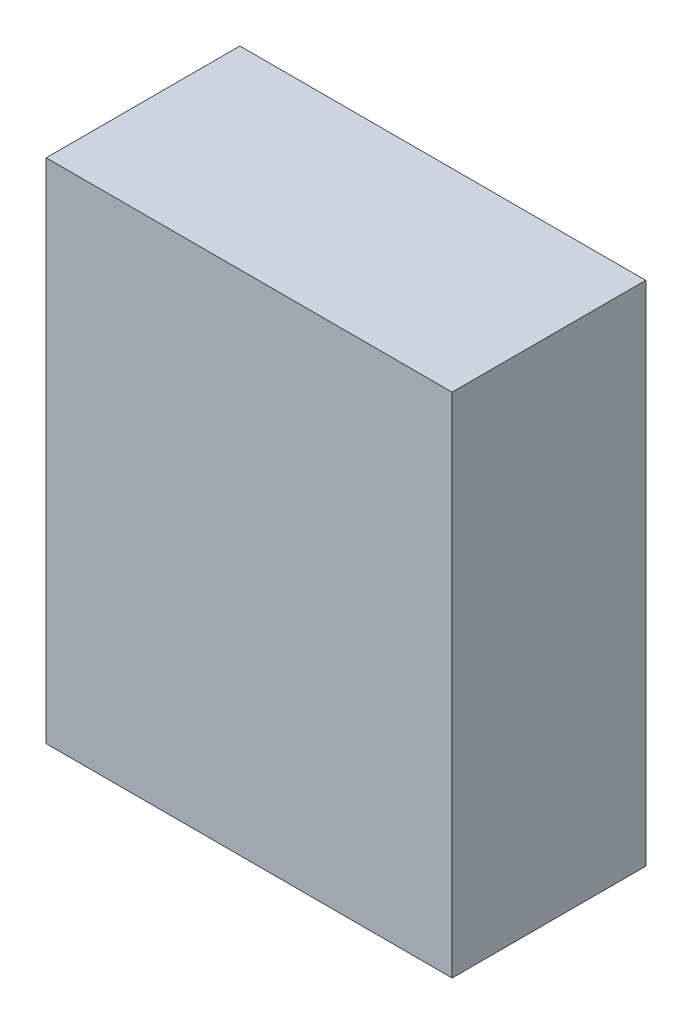
ISO-10303-21;
HEADER;
FILE_DESCRIPTION(('STEP AP214'),'2;1');
FILE_NAME('part.step','',(''),(''),'','','');
FILE_SCHEMA(('AUTOMOTIVE_DESIGN { 1 0 10303 214 1 1 1 1 }'));
ENDSEC;
DATA;
#1=APPLICATION_CONTEXT('core data for automotive mechanical design processes');
#2=APPLICATION_PROTOCOL_DEFINITION('international standard','automotive_design',2000,#1);
#3=PRODUCT_CONTEXT('',#1,'mechanical');
#4=PRODUCT('Part','Part','',(#3));
#5=PRODUCT_RELATED_PRODUCT_CATEGORY('part','',(#4));
#6=PRODUCT_DEFINITION_FORMATION('','',#4);
#7=PRODUCT_DEFINITION_CONTEXT('part definition',#1,'design');
#8=PRODUCT_DEFINITION('design','',#6,#7);
#9=PRODUCT_DEFINITION_SHAPE('','',#8);
#10=(LENGTH_UNIT() NAMED_UNIT(*) SI_UNIT(.MILLI.,.METRE.));
#11=(NAMED_UNIT(*) PLANE_ANGLE_UNIT() SI_UNIT($,.RADIAN.));
#12=(NAMED_UNIT(*) SI_UNIT($,.STERADIAN.) SOLID_ANGLE_UNIT());
#13=UNCERTAINTY_MEASURE_WITH_UNIT(LENGTH_MEASURE(1.E-05),#10,'distance_accuracy_value','');
#14=(GEOMETRIC_REPRESENTATION_CONTEXT(3) GLOBAL_UNCERTAINTY_ASSIGNED_CONTEXT((#13)) GLOBAL_UNIT_ASSIGNED_CONTEXT((#10,
#11,#12)) REPRESENTATION_CONTEXT('',''));
#15=CARTESIAN_POINT('',(0.,0.,0.));
#16=DIRECTION('',(0.,0.,1.));
#17=DIRECTION('',(1.,0.,0.));
#18=AXIS2_PLACEMENT_3D('',#15,#16,#17);
#19=CARTESIAN_POINT('',(2.40000028,-2.99999908,2.2900005));
#20=DIRECTION('',(0.,0.,-1.));
#21=DIRECTION('',(-1.,0.,0.));
#22=AXIS2_PLACEMENT_3D('',#19,#20,#21);
#23=PLANE('',#22);
#24=DIRECTION('',(1.,0.,0.));
#25=VECTOR('',#24,1.);
#26=CARTESIAN_POINT('',(2.40000028,2.99999908,2.2900005));
#27=LINE('',#26,#25);
#28=CARTESIAN_POINT('',(2.40000028,2.99999908,2.2900005));
#29=VERTEX_POINT('',#28);
#30=CARTESIAN_POINT('',(-2.40000028,2.99999908,2.2900005));
#31=VERTEX_POINT('',#30);
#32=EDGE_CURVE('E55',#29,#31,#27,.F.);
#33=ORIENTED_EDGE('',*,*,#32,.T.);
#34=DIRECTION('',(0.,1.,0.));
#35=VECTOR('',#34,1.);
#36=CARTESIAN_POINT('',(-2.40000028,2.99999908,2.2900005));
#37=LINE('',#36,#35);
#38=CARTESIAN_POINT('',(-2.40000028,-2.99999908,2.2900005));
#39=VERTEX_POINT('',#38);
#40=EDGE_CURVE('E57',#31,#39,#37,.F.);
#41=ORIENTED_EDGE('',*,*,#40,.T.);
#42=DIRECTION('',(1.,0.,0.));
#43=VECTOR('',#42,1.);
#44=CARTESIAN_POINT('',(-2.40000028,-2.99999908,2.2900005));
#45=LINE('',#44,#43);
#46=CARTESIAN_POINT('',(2.40000028,-2.99999908,2.2900005));
#47=VERTEX_POINT('',#46);
#48=EDGE_CURVE('E20',#39,#47,#45,.T.);
#49=ORIENTED_EDGE('',*,*,#48,.T.);
#50=DIRECTION('',(0.,1.,0.));
#51=VECTOR('',#50,1.);
#52=CARTESIAN_POINT('',(2.40000028,-2.99999908,2.2900005));
#53=LINE('',#52,#51);
#54=EDGE_CURVE('E80',#47,#29,#53,.T.);
#55=ORIENTED_EDGE('',*,*,#54,.T.);
#56=EDGE_LOOP('',(#33,#41,#49,#55));
#57=FACE_BOUND('',#56,.T.);
#58=ADVANCED_FACE('F17',(#57),#23,.F.);
#59=CARTESIAN_POINT('',(-2.40000028,-2.99999908,0.));
#60=DIRECTION('',(0.,1.,0.));
#61=DIRECTION('',(0.,0.,1.));
#62=AXIS2_PLACEMENT_3D('',#59,#60,#61);
#63=PLANE('',#62);
#64=DIRECTION('',(0.,0.,1.));
#65=VECTOR('',#64,1.);
#66=CARTESIAN_POINT('',(2.40000028,-2.99999908,0.));
#67=LINE('',#66,#65);
#68=CARTESIAN_POINT('',(2.40000028,-2.99999908,0.));
#69=VERTEX_POINT('',#68);
#70=EDGE_CURVE('E68',#69,#47,#67,.T.);
#71=ORIENTED_EDGE('',*,*,#70,.T.);
#72=ORIENTED_EDGE('',*,*,#48,.F.);
#73=DIRECTION('',(0.,0.,-1.));
#74=VECTOR('',#73,1.);
#75=CARTESIAN_POINT('',(-2.40000028,-2.99999908,0.));
#76=LINE('',#75,#74);
#77=CARTESIAN_POINT('',(-2.40000028,-2.99999908,0.));
#78=VERTEX_POINT('',#77);
#79=EDGE_CURVE('E63',#39,#78,#76,.T.);
#80=ORIENTED_EDGE('',*,*,#79,.T.);
#81=DIRECTION('',(-1.,0.,0.));
#82=VECTOR('',#81,1.);
#83=CARTESIAN_POINT('',(2.40000028,-2.99999908,0.));
#84=LINE('',#83,#82);
#85=EDGE_CURVE('E83',#69,#78,#84,.T.);
#86=ORIENTED_EDGE('',*,*,#85,.F.);
#87=EDGE_LOOP('',(#71,#72,#80,#86));
#88=FACE_BOUND('',#87,.T.);
#89=ADVANCED_FACE('F65',(#88),#63,.F.);
#90=CARTESIAN_POINT('',(-2.40000028,2.99999908,0.));
#91=DIRECTION('',(1.,0.,0.));
#92=DIRECTION('',(0.,0.,-1.));
#93=AXIS2_PLACEMENT_3D('',#90,#91,#92);
#94=PLANE('',#93);
#95=ORIENTED_EDGE('',*,*,#79,.F.);
#96=ORIENTED_EDGE('',*,*,#40,.F.);
#97=DIRECTION('',(0.,0.,-1.));
#98=VECTOR('',#97,1.);
#99=CARTESIAN_POINT('',(-2.40000028,2.99999908,0.));
#100=LINE('',#99,#98);
#101=CARTESIAN_POINT('',(-2.40000028,2.99999908,0.));
#102=VERTEX_POINT('',#101);
#103=EDGE_CURVE('E75',#31,#102,#100,.T.);
#104=ORIENTED_EDGE('',*,*,#103,.T.);
#105=DIRECTION('',(0.,1.,0.));
#106=VECTOR('',#105,1.);
#107=CARTESIAN_POINT('',(-2.40000028,-2.99999908,0.));
#108=LINE('',#107,#106);
#109=EDGE_CURVE('E72',#78,#102,#108,.T.);
#110=ORIENTED_EDGE('',*,*,#109,.F.);
#111=EDGE_LOOP('',(#95,#96,#104,#110));
#112=FACE_BOUND('',#111,.T.);
#113=ADVANCED_FACE('F70',(#112),#94,.F.);
#114=CARTESIAN_POINT('',(2.40000028,2.99999908,0.));
#115=DIRECTION('',(0.,-1.,0.));
#116=DIRECTION('',(0.,0.,-1.));
#117=AXIS2_PLACEMENT_3D('',#114,#115,#116);
#118=PLANE('',#117);
#119=ORIENTED_EDGE('',*,*,#103,.F.);
#120=ORIENTED_EDGE('',*,*,#32,.F.);
#121=DIRECTION('',(0.,0.,1.));
#122=VECTOR('',#121,1.);
#123=CARTESIAN_POINT('',(2.40000028,2.99999908,0.));
#124=LINE('',#123,#122);
#125=CARTESIAN_POINT('',(2.40000028,2.99999908,0.));
#126=VERTEX_POINT('',#125);
#127=EDGE_CURVE('E35',#29,#126,#124,.F.);
#128=ORIENTED_EDGE('',*,*,#127,.T.);
#129=DIRECTION('',(-1.,0.,0.));
#130=VECTOR('',#129,1.);
#131=CARTESIAN_POINT('',(2.40000028,2.99999908,0.));
#132=LINE('',#131,#130);
#133=EDGE_CURVE('E26',#102,#126,#132,.F.);
#134=ORIENTED_EDGE('',*,*,#133,.F.);
#135=EDGE_LOOP('',(#119,#120,#128,#134));
#136=FACE_BOUND('',#135,.T.);
#137=ADVANCED_FACE('F89',(#136),#118,.F.);
#138=CARTESIAN_POINT('',(2.40000028,-2.99999908,0.));
#139=DIRECTION('',(-1.,0.,0.));
#140=DIRECTION('',(0.,0.,1.));
#141=AXIS2_PLACEMENT_3D('',#138,#139,#140);
#142=PLANE('',#141);
#143=ORIENTED_EDGE('',*,*,#127,.F.);
#144=ORIENTED_EDGE('',*,*,#54,.F.);
#145=ORIENTED_EDGE('',*,*,#70,.F.);
#146=DIRECTION('',(0.,1.,0.));
#147=VECTOR('',#146,1.);
#148=CARTESIAN_POINT('',(2.40000028,-2.99999908,0.));
#149=LINE('',#148,#147);
#150=EDGE_CURVE('E11',#126,#69,#149,.F.);
#151=ORIENTED_EDGE('',*,*,#150,.F.);
#152=EDGE_LOOP('',(#143,#144,#145,#151));
#153=FACE_BOUND('',#152,.T.);
#154=ADVANCED_FACE('F91',(#153),#142,.F.);
#155=CARTESIAN_POINT('',(2.40000028,-2.99999908,0.));
#156=DIRECTION('',(0.,0.,-1.));
#157=DIRECTION('',(-1.,0.,0.));
#158=AXIS2_PLACEMENT_3D('',#155,#156,#157);
#159=PLANE('',#158);
#160=ORIENTED_EDGE('',*,*,#133,.T.);
#161=ORIENTED_EDGE('',*,*,#150,.T.);
#162=ORIENTED_EDGE('',*,*,#85,.T.);
#163=ORIENTED_EDGE('',*,*,#109,.T.);
#164=EDGE_LOOP('',(#160,#161,#162,#163));
#165=FACE_BOUND('',#164,.T.);
#166=ADVANCED_FACE('F88',(#165),#159,.T.);
#167=CLOSED_SHELL('',(#58,#89,#113,#137,#154,#166));
#168=MANIFOLD_SOLID_BREP('B1',#167);
#169=ADVANCED_BREP_SHAPE_REPRESENTATION('',(#18,#168),#14);
#170=SHAPE_DEFINITION_REPRESENTATION(#9,#169);
ENDSEC;
END-ISO-10303-21;
